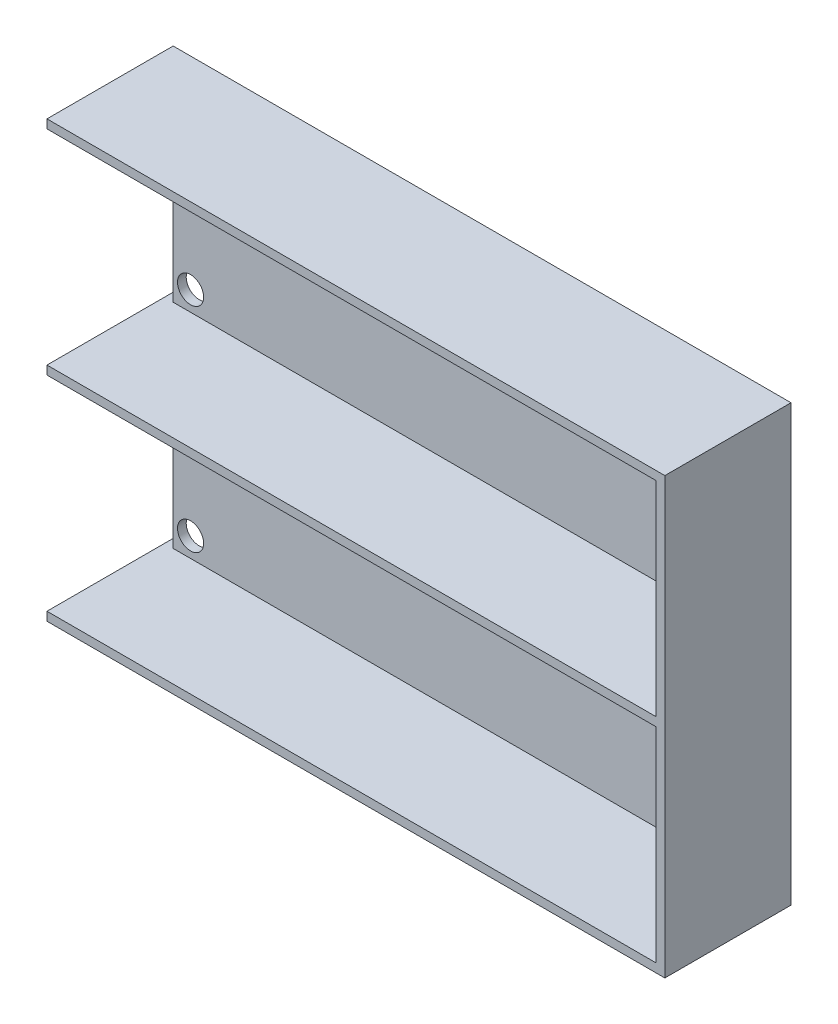
ISO-10303-21;
HEADER;
FILE_DESCRIPTION(('STEP AP214'),'2;1');
FILE_NAME('part.step','',(''),(''),'','','');
FILE_SCHEMA(('AUTOMOTIVE_DESIGN { 1 0 10303 214 1 1 1 1 }'));
ENDSEC;
DATA;
#1=APPLICATION_CONTEXT('core data for automotive mechanical design processes');
#2=APPLICATION_PROTOCOL_DEFINITION('international standard','automotive_design',2000,#1);
#3=PRODUCT_CONTEXT('',#1,'mechanical');
#4=PRODUCT('Part','Part','',(#3));
#5=PRODUCT_RELATED_PRODUCT_CATEGORY('part','',(#4));
#6=PRODUCT_DEFINITION_FORMATION('','',#4);
#7=PRODUCT_DEFINITION_CONTEXT('part definition',#1,'design');
#8=PRODUCT_DEFINITION('design','',#6,#7);
#9=PRODUCT_DEFINITION_SHAPE('','',#8);
#10=(LENGTH_UNIT() NAMED_UNIT(*) SI_UNIT(.MILLI.,.METRE.));
#11=(NAMED_UNIT(*) PLANE_ANGLE_UNIT() SI_UNIT($,.RADIAN.));
#12=(NAMED_UNIT(*) SI_UNIT($,.STERADIAN.) SOLID_ANGLE_UNIT());
#13=UNCERTAINTY_MEASURE_WITH_UNIT(LENGTH_MEASURE(1.E-05),#10,'distance_accuracy_value','');
#14=(GEOMETRIC_REPRESENTATION_CONTEXT(3) GLOBAL_UNCERTAINTY_ASSIGNED_CONTEXT((#13)) GLOBAL_UNIT_ASSIGNED_CONTEXT((#10,
#11,#12)) REPRESENTATION_CONTEXT('',''));
#15=CARTESIAN_POINT('',(0.,0.,0.));
#16=DIRECTION('',(0.,0.,1.));
#17=DIRECTION('',(1.,0.,0.));
#18=AXIS2_PLACEMENT_3D('',#15,#16,#17);
#19=CARTESIAN_POINT('',(-62.5513317977968,46.7896654801157,2.));
#20=DIRECTION('',(1.,0.,0.));
#21=DIRECTION('',(0.,1.,0.));
#22=AXIS2_PLACEMENT_3D('',#19,#20,#21);
#23=PLANE('',#22);
#24=DIRECTION('',(0.,0.,-1.));
#25=VECTOR('',#24,1.);
#26=CARTESIAN_POINT('',(-62.5513317977967,-51.2103345198843,29.));
#27=LINE('',#26,#25);
#28=CARTESIAN_POINT('',(-62.5513317977967,-51.2103345198843,29.));
#29=VERTEX_POINT('',#28);
#30=CARTESIAN_POINT('',(-62.5513317977967,-51.2103345198843,0.));
#31=VERTEX_POINT('',#30);
#32=EDGE_CURVE('E227',#29,#31,#27,.T.);
#33=ORIENTED_EDGE('',*,*,#32,.T.);
#34=DIRECTION('',(0.,-1.,0.));
#35=VECTOR('',#34,1.);
#36=CARTESIAN_POINT('',(-62.5513317977968,46.7896654801157,0.));
#37=LINE('',#36,#35);
#38=CARTESIAN_POINT('',(-62.5513317977967,-53.2103345198843,0.));
#39=VERTEX_POINT('',#38);
#40=EDGE_CURVE('E252',#31,#39,#37,.T.);
#41=ORIENTED_EDGE('',*,*,#40,.T.);
#42=DIRECTION('',(0.,0.,-1.));
#43=VECTOR('',#42,1.);
#44=CARTESIAN_POINT('',(-62.5513317977967,-53.2103345198843,2.));
#45=LINE('',#44,#43);
#46=CARTESIAN_POINT('',(-62.5513317977967,-53.2103345198843,29.));
#47=VERTEX_POINT('',#46);
#48=EDGE_CURVE('E11',#47,#39,#45,.T.);
#49=ORIENTED_EDGE('',*,*,#48,.F.);
#50=DIRECTION('',(0.,-1.,0.));
#51=VECTOR('',#50,1.);
#52=CARTESIAN_POINT('',(-62.5513317977967,-53.2103345198843,29.));
#53=LINE('',#52,#51);
#54=EDGE_CURVE('E199',#29,#47,#53,.T.);
#55=ORIENTED_EDGE('',*,*,#54,.F.);
#56=EDGE_LOOP('',(#33,#41,#49,#55));
#57=FACE_BOUND('',#56,.T.);
#58=ADVANCED_FACE('F34',(#57),#23,.F.);
#59=CARTESIAN_POINT('',(-62.5513317977968,46.7896654801157,0.));
#60=VERTEX_POINT('',#59);
#61=CARTESIAN_POINT('',(-62.5513317977968,44.7896654801157,0.));
#62=VERTEX_POINT('',#61);
#63=EDGE_CURVE('E270',#60,#62,#37,.T.);
#64=ORIENTED_EDGE('',*,*,#63,.T.);
#65=DIRECTION('',(0.,0.,-1.));
#66=VECTOR('',#65,1.);
#67=CARTESIAN_POINT('',(-62.5513317977968,44.7896654801157,29.));
#68=LINE('',#67,#66);
#69=CARTESIAN_POINT('',(-62.5513317977968,44.7896654801157,29.));
#70=VERTEX_POINT('',#69);
#71=EDGE_CURVE('E250',#70,#62,#68,.T.);
#72=ORIENTED_EDGE('',*,*,#71,.F.);
#73=DIRECTION('',(0.,-1.,0.));
#74=VECTOR('',#73,1.);
#75=CARTESIAN_POINT('',(-62.5513317977968,46.7896654801157,29.));
#76=LINE('',#75,#74);
#77=CARTESIAN_POINT('',(-62.5513317977968,46.7896654801157,29.));
#78=VERTEX_POINT('',#77);
#79=EDGE_CURVE('E211',#78,#70,#76,.T.);
#80=ORIENTED_EDGE('',*,*,#79,.F.);
#81=DIRECTION('',(0.,0.,-1.));
#82=VECTOR('',#81,1.);
#83=CARTESIAN_POINT('',(-62.5513317977968,46.7896654801157,2.));
#84=LINE('',#83,#82);
#85=EDGE_CURVE('E280',#78,#60,#84,.T.);
#86=ORIENTED_EDGE('',*,*,#85,.T.);
#87=EDGE_LOOP('',(#64,#72,#80,#86));
#88=FACE_BOUND('',#87,.T.);
#89=ADVANCED_FACE('F300',(#88),#23,.F.);
#90=CARTESIAN_POINT('',(0.,0.,2.));
#91=DIRECTION('',(0.,0.,1.));
#92=DIRECTION('',(1.,0.,0.));
#93=AXIS2_PLACEMENT_3D('',#90,#91,#92);
#94=PLANE('',#93);
#95=CARTESIAN_POINT('',(-56.5513317977968,-46.7103345198843,2.));
#96=DIRECTION('',(0.,0.,1.));
#97=DIRECTION('',(1.,0.,0.));
#98=AXIS2_PLACEMENT_3D('',#95,#96,#97);
#99=CIRCLE('',#98,3.);
#100=CARTESIAN_POINT('',(-53.5513317977968,-46.7103345198843,2.));
#101=VERTEX_POINT('',#100);
#102=EDGE_CURVE('E579',#101,#101,#99,.T.);
#103=ORIENTED_EDGE('',*,*,#102,.F.);
#104=EDGE_LOOP('',(#103));
#105=FACE_BOUND('',#104,.T.);
#106=CARTESIAN_POINT('',(-56.5513317977968,-8.71033451988431,2.));
#107=DIRECTION('',(0.,0.,1.));
#108=DIRECTION('',(1.,0.,0.));
#109=AXIS2_PLACEMENT_3D('',#106,#107,#108);
#110=CIRCLE('',#109,3.);
#111=CARTESIAN_POINT('',(-53.5513317977968,-8.71033451988431,2.));
#112=VERTEX_POINT('',#111);
#113=EDGE_CURVE('E589',#112,#112,#110,.T.);
#114=ORIENTED_EDGE('',*,*,#113,.F.);
#115=EDGE_LOOP('',(#114));
#116=FACE_BOUND('',#115,.T.);
#117=DIRECTION('',(0.,1.,0.));
#118=VECTOR('',#117,1.);
#119=CARTESIAN_POINT('',(-60.5513317977967,-4.21033451988427,2.));
#120=LINE('',#119,#118);
#121=CARTESIAN_POINT('',(-60.5513317977967,-51.2103345198843,2.));
#122=VERTEX_POINT('',#121);
#123=CARTESIAN_POINT('',(-60.5513317977967,-4.21033451988427,2.));
#124=VERTEX_POINT('',#123);
#125=EDGE_CURVE('E157',#122,#124,#120,.T.);
#126=ORIENTED_EDGE('',*,*,#125,.F.);
#127=DIRECTION('',(-1.,0.,0.));
#128=VECTOR('',#127,1.);
#129=CARTESIAN_POINT('',(-62.5513317977967,-51.2103345198843,2.));
#130=LINE('',#129,#128);
#131=CARTESIAN_POINT('',(77.4486682022033,-51.2103345198843,2.));
#132=VERTEX_POINT('',#131);
#133=EDGE_CURVE('E52',#132,#122,#130,.T.);
#134=ORIENTED_EDGE('',*,*,#133,.F.);
#135=DIRECTION('',(0.,-1.,0.));
#136=VECTOR('',#135,1.);
#137=CARTESIAN_POINT('',(77.4486682022033,-51.2103345198843,2.));
#138=LINE('',#137,#136);
#139=CARTESIAN_POINT('',(77.4486682022033,-4.21033451988427,2.));
#140=VERTEX_POINT('',#139);
#141=EDGE_CURVE('E234',#140,#132,#138,.T.);
#142=ORIENTED_EDGE('',*,*,#141,.F.);
#143=DIRECTION('',(1.,0.,0.));
#144=VECTOR('',#143,1.);
#145=CARTESIAN_POINT('',(-62.5513317977968,-4.21033451988427,2.));
#146=LINE('',#145,#144);
#147=EDGE_CURVE('E38',#124,#140,#146,.T.);
#148=ORIENTED_EDGE('',*,*,#147,.F.);
#149=EDGE_LOOP('',(#126,#134,#142,#148));
#150=FACE_BOUND('',#149,.T.);
#151=ADVANCED_FACE('F337',(#105,#116,#150),#94,.T.);
#152=CARTESIAN_POINT('',(-62.5513317977968,-2.21033451988435,0.));
#153=VERTEX_POINT('',#152);
#154=CARTESIAN_POINT('',(-62.5513317977968,-4.21033451988427,0.));
#155=VERTEX_POINT('',#154);
#156=EDGE_CURVE('E274',#153,#155,#37,.T.);
#157=ORIENTED_EDGE('',*,*,#156,.T.);
#158=DIRECTION('',(0.,0.,-1.));
#159=VECTOR('',#158,1.);
#160=CARTESIAN_POINT('',(-62.5513317977968,-4.21033451988427,29.));
#161=LINE('',#160,#159);
#162=CARTESIAN_POINT('',(-62.5513317977968,-4.21033451988427,29.));
#163=VERTEX_POINT('',#162);
#164=EDGE_CURVE('E166',#163,#155,#161,.T.);
#165=ORIENTED_EDGE('',*,*,#164,.F.);
#166=DIRECTION('',(0.,-1.,0.));
#167=VECTOR('',#166,1.);
#168=CARTESIAN_POINT('',(-62.5513317977968,-2.21033451988436,29.));
#169=LINE('',#168,#167);
#170=CARTESIAN_POINT('',(-62.5513317977968,-2.21033451988436,29.));
#171=VERTEX_POINT('',#170);
#172=EDGE_CURVE('E219',#171,#163,#169,.T.);
#173=ORIENTED_EDGE('',*,*,#172,.F.);
#174=DIRECTION('',(0.,0.,-1.));
#175=VECTOR('',#174,1.);
#176=CARTESIAN_POINT('',(-62.5513317977968,-2.21033451988436,29.));
#177=LINE('',#176,#175);
#178=EDGE_CURVE('E242',#171,#153,#177,.T.);
#179=ORIENTED_EDGE('',*,*,#178,.T.);
#180=EDGE_LOOP('',(#157,#165,#173,#179));
#181=FACE_BOUND('',#180,.T.);
#182=ADVANCED_FACE('F36',(#181),#23,.F.);
#183=CARTESIAN_POINT('',(-62.5513317977967,-53.2103345198843,2.));
#184=DIRECTION('',(0.,1.,0.));
#185=DIRECTION('',(0.,0.,1.));
#186=AXIS2_PLACEMENT_3D('',#183,#184,#185);
#187=PLANE('',#186);
#188=DIRECTION('',(1.,0.,0.));
#189=VECTOR('',#188,1.);
#190=CARTESIAN_POINT('',(-62.5513317977967,-53.2103345198843,0.));
#191=LINE('',#190,#189);
#192=CARTESIAN_POINT('',(79.4486682022032,-53.2103345198843,0.));
#193=VERTEX_POINT('',#192);
#194=EDGE_CURVE('E273',#39,#193,#191,.T.);
#195=ORIENTED_EDGE('',*,*,#194,.T.);
#196=DIRECTION('',(0.,0.,-1.));
#197=VECTOR('',#196,1.);
#198=CARTESIAN_POINT('',(79.4486682022032,-53.2103345198843,2.));
#199=LINE('',#198,#197);
#200=CARTESIAN_POINT('',(79.4486682022032,-53.2103345198843,29.));
#201=VERTEX_POINT('',#200);
#202=EDGE_CURVE('E44',#201,#193,#199,.T.);
#203=ORIENTED_EDGE('',*,*,#202,.F.);
#204=DIRECTION('',(1.,0.,0.));
#205=VECTOR('',#204,1.);
#206=CARTESIAN_POINT('',(-62.5513317977967,-53.2103345198843,29.));
#207=LINE('',#206,#205);
#208=EDGE_CURVE('E202',#47,#201,#207,.T.);
#209=ORIENTED_EDGE('',*,*,#208,.F.);
#210=ORIENTED_EDGE('',*,*,#48,.T.);
#211=EDGE_LOOP('',(#195,#203,#209,#210));
#212=FACE_BOUND('',#211,.T.);
#213=ADVANCED_FACE('F307',(#212),#187,.F.);
#214=CARTESIAN_POINT('',(79.4486682022032,46.7896654801157,2.));
#215=DIRECTION('',(-1.,0.,0.));
#216=DIRECTION('',(0.,-1.,0.));
#217=AXIS2_PLACEMENT_3D('',#214,#215,#216);
#218=PLANE('',#217);
#219=DIRECTION('',(0.,1.,0.));
#220=VECTOR('',#219,1.);
#221=CARTESIAN_POINT('',(79.4486682022032,46.7896654801157,0.));
#222=LINE('',#221,#220);
#223=CARTESIAN_POINT('',(79.4486682022032,46.7896654801157,0.));
#224=VERTEX_POINT('',#223);
#225=EDGE_CURVE('E276',#193,#224,#222,.T.);
#226=ORIENTED_EDGE('',*,*,#225,.T.);
#227=DIRECTION('',(0.,0.,-1.));
#228=VECTOR('',#227,1.);
#229=CARTESIAN_POINT('',(79.4486682022032,46.7896654801157,2.));
#230=LINE('',#229,#228);
#231=CARTESIAN_POINT('',(79.4486682022032,46.7896654801157,29.));
#232=VERTEX_POINT('',#231);
#233=EDGE_CURVE('E283',#232,#224,#230,.T.);
#234=ORIENTED_EDGE('',*,*,#233,.F.);
#235=DIRECTION('',(0.,1.,0.));
#236=VECTOR('',#235,1.);
#237=CARTESIAN_POINT('',(79.4486682022032,-53.2103345198843,29.));
#238=LINE('',#237,#236);
#239=EDGE_CURVE('E205',#201,#232,#238,.T.);
#240=ORIENTED_EDGE('',*,*,#239,.F.);
#241=ORIENTED_EDGE('',*,*,#202,.T.);
#242=EDGE_LOOP('',(#226,#234,#240,#241));
#243=FACE_BOUND('',#242,.T.);
#244=ADVANCED_FACE('F289',(#243),#218,.F.);
#245=CARTESIAN_POINT('',(-62.5513317977968,46.7896654801157,2.));
#246=DIRECTION('',(0.,-1.,0.));
#247=DIRECTION('',(0.,0.,-1.));
#248=AXIS2_PLACEMENT_3D('',#245,#246,#247);
#249=PLANE('',#248);
#250=DIRECTION('',(-1.,0.,0.));
#251=VECTOR('',#250,1.);
#252=CARTESIAN_POINT('',(-62.5513317977968,46.7896654801157,0.));
#253=LINE('',#252,#251);
#254=EDGE_CURVE('E278',#224,#60,#253,.T.);
#255=ORIENTED_EDGE('',*,*,#254,.T.);
#256=ORIENTED_EDGE('',*,*,#85,.F.);
#257=DIRECTION('',(-1.,0.,0.));
#258=VECTOR('',#257,1.);
#259=CARTESIAN_POINT('',(79.4486682022032,46.7896654801157,29.));
#260=LINE('',#259,#258);
#261=EDGE_CURVE('E208',#232,#78,#260,.T.);
#262=ORIENTED_EDGE('',*,*,#261,.F.);
#263=ORIENTED_EDGE('',*,*,#233,.T.);
#264=EDGE_LOOP('',(#255,#256,#262,#263));
#265=FACE_BOUND('',#264,.T.);
#266=ADVANCED_FACE('F296',(#265),#249,.F.);
#267=CARTESIAN_POINT('',(-56.5513317977968,2.28966548011569,2.));
#268=DIRECTION('',(0.,0.,1.));
#269=DIRECTION('',(1.,0.,0.));
#270=AXIS2_PLACEMENT_3D('',#267,#268,#269);
#271=CIRCLE('',#270,3.);
#272=CARTESIAN_POINT('',(-53.5513317977968,2.28966548011569,2.));
#273=VERTEX_POINT('',#272);
#274=EDGE_CURVE('E595',#273,#273,#271,.T.);
#275=ORIENTED_EDGE('',*,*,#274,.F.);
#276=EDGE_LOOP('',(#275));
#277=FACE_BOUND('',#276,.T.);
#278=CARTESIAN_POINT('',(-56.5513317977968,40.2896654801157,2.));
#279=DIRECTION('',(0.,0.,1.));
#280=DIRECTION('',(1.,0.,0.));
#281=AXIS2_PLACEMENT_3D('',#278,#279,#280);
#282=CIRCLE('',#281,3.);
#283=CARTESIAN_POINT('',(-53.5513317977968,40.2896654801157,2.));
#284=VERTEX_POINT('',#283);
#285=EDGE_CURVE('E175',#284,#284,#282,.T.);
#286=ORIENTED_EDGE('',*,*,#285,.F.);
#287=EDGE_LOOP('',(#286));
#288=FACE_BOUND('',#287,.T.);
#289=DIRECTION('',(0.,1.,0.));
#290=VECTOR('',#289,1.);
#291=CARTESIAN_POINT('',(-60.5513317977967,-2.21033451988435,2.));
#292=LINE('',#291,#290);
#293=CARTESIAN_POINT('',(-60.5513317977967,-2.21033451988435,2.));
#294=VERTEX_POINT('',#293);
#295=CARTESIAN_POINT('',(-60.5513317977967,44.7896654801157,2.));
#296=VERTEX_POINT('',#295);
#297=EDGE_CURVE('E181',#294,#296,#292,.T.);
#298=ORIENTED_EDGE('',*,*,#297,.F.);
#299=DIRECTION('',(-1.,0.,0.));
#300=VECTOR('',#299,1.);
#301=CARTESIAN_POINT('',(-62.5513317977968,-2.21033451988436,2.));
#302=LINE('',#301,#300);
#303=CARTESIAN_POINT('',(77.4486682022033,-2.21033451988436,2.));
#304=VERTEX_POINT('',#303);
#305=EDGE_CURVE('E231',#304,#294,#302,.T.);
#306=ORIENTED_EDGE('',*,*,#305,.F.);
#307=DIRECTION('',(0.,-1.,0.));
#308=VECTOR('',#307,1.);
#309=CARTESIAN_POINT('',(77.4486682022033,-2.21033451988436,2.));
#310=LINE('',#309,#308);
#311=CARTESIAN_POINT('',(77.4486682022032,44.7896654801157,2.));
#312=VERTEX_POINT('',#311);
#313=EDGE_CURVE('E228',#312,#304,#310,.T.);
#314=ORIENTED_EDGE('',*,*,#313,.F.);
#315=DIRECTION('',(1.,0.,0.));
#316=VECTOR('',#315,1.);
#317=CARTESIAN_POINT('',(77.4486682022032,44.7896654801157,2.));
#318=LINE('',#317,#316);
#319=EDGE_CURVE('E197',#296,#312,#318,.T.);
#320=ORIENTED_EDGE('',*,*,#319,.F.);
#321=EDGE_LOOP('',(#298,#306,#314,#320));
#322=FACE_BOUND('',#321,.T.);
#323=ADVANCED_FACE('F341',(#277,#288,#322),#94,.T.);
#324=CARTESIAN_POINT('',(0.,0.,0.));
#325=DIRECTION('',(0.,0.,1.));
#326=DIRECTION('',(1.,0.,0.));
#327=AXIS2_PLACEMENT_3D('',#324,#325,#326);
#328=PLANE('',#327);
#329=CARTESIAN_POINT('',(-56.5513317977968,-46.7103345198843,0.));
#330=DIRECTION('',(0.,0.,-1.));
#331=DIRECTION('',(-1.,0.,0.));
#332=AXIS2_PLACEMENT_3D('',#329,#330,#331);
#333=CIRCLE('',#332,3.);
#334=CARTESIAN_POINT('',(-59.5513317977968,-46.7103345198843,0.));
#335=VERTEX_POINT('',#334);
#336=EDGE_CURVE('E582',#335,#335,#333,.T.);
#337=ORIENTED_EDGE('',*,*,#336,.F.);
#338=EDGE_LOOP('',(#337));
#339=FACE_BOUND('',#338,.T.);
#340=CARTESIAN_POINT('',(-56.5513317977968,-8.71033451988431,0.));
#341=DIRECTION('',(0.,0.,-1.));
#342=DIRECTION('',(-1.,0.,0.));
#343=AXIS2_PLACEMENT_3D('',#340,#341,#342);
#344=CIRCLE('',#343,3.);
#345=CARTESIAN_POINT('',(-59.5513317977968,-8.71033451988431,0.));
#346=VERTEX_POINT('',#345);
#347=EDGE_CURVE('E584',#346,#346,#344,.T.);
#348=ORIENTED_EDGE('',*,*,#347,.F.);
#349=EDGE_LOOP('',(#348));
#350=FACE_BOUND('',#349,.T.);
#351=CARTESIAN_POINT('',(-56.5513317977968,2.28966548011569,0.));
#352=DIRECTION('',(0.,0.,-1.));
#353=DIRECTION('',(-1.,0.,0.));
#354=AXIS2_PLACEMENT_3D('',#351,#352,#353);
#355=CIRCLE('',#354,3.);
#356=CARTESIAN_POINT('',(-59.5513317977968,2.28966548011569,0.));
#357=VERTEX_POINT('',#356);
#358=EDGE_CURVE('E592',#357,#357,#355,.T.);
#359=ORIENTED_EDGE('',*,*,#358,.F.);
#360=EDGE_LOOP('',(#359));
#361=FACE_BOUND('',#360,.T.);
#362=CARTESIAN_POINT('',(-56.5513317977968,40.2896654801157,0.));
#363=DIRECTION('',(0.,0.,-1.));
#364=DIRECTION('',(-1.,0.,0.));
#365=AXIS2_PLACEMENT_3D('',#362,#363,#364);
#366=CIRCLE('',#365,3.);
#367=CARTESIAN_POINT('',(-59.5513317977968,40.2896654801157,0.));
#368=VERTEX_POINT('',#367);
#369=EDGE_CURVE('E597',#368,#368,#366,.T.);
#370=ORIENTED_EDGE('',*,*,#369,.F.);
#371=EDGE_LOOP('',(#370));
#372=FACE_BOUND('',#371,.T.);
#373=ORIENTED_EDGE('',*,*,#40,.F.);
#374=DIRECTION('',(1.,0.,0.));
#375=VECTOR('',#374,1.);
#376=CARTESIAN_POINT('',(-60.5513317977967,-51.2103345198843,0.));
#377=LINE('',#376,#375);
#378=CARTESIAN_POINT('',(-60.5513317977967,-51.2103345198843,0.));
#379=VERTEX_POINT('',#378);
#380=EDGE_CURVE('E159',#31,#379,#377,.T.);
#381=ORIENTED_EDGE('',*,*,#380,.T.);
#382=DIRECTION('',(0.,1.,0.));
#383=VECTOR('',#382,1.);
#384=CARTESIAN_POINT('',(-60.5513317977967,-4.21033451988427,0.));
#385=LINE('',#384,#383);
#386=CARTESIAN_POINT('',(-60.5513317977967,-4.21033451988427,0.));
#387=VERTEX_POINT('',#386);
#388=EDGE_CURVE('E155',#379,#387,#385,.T.);
#389=ORIENTED_EDGE('',*,*,#388,.T.);
#390=DIRECTION('',(-1.,0.,0.));
#391=VECTOR('',#390,1.);
#392=CARTESIAN_POINT('',(-60.5513317977967,-4.21033451988427,0.));
#393=LINE('',#392,#391);
#394=EDGE_CURVE('E162',#387,#155,#393,.T.);
#395=ORIENTED_EDGE('',*,*,#394,.T.);
#396=ORIENTED_EDGE('',*,*,#156,.F.);
#397=DIRECTION('',(1.,0.,0.));
#398=VECTOR('',#397,1.);
#399=CARTESIAN_POINT('',(-62.5513317977968,-2.21033451988435,0.));
#400=LINE('',#399,#398);
#401=CARTESIAN_POINT('',(-60.5513317977967,-2.21033451988435,0.));
#402=VERTEX_POINT('',#401);
#403=EDGE_CURVE('E183',#153,#402,#400,.T.);
#404=ORIENTED_EDGE('',*,*,#403,.T.);
#405=DIRECTION('',(0.,1.,0.));
#406=VECTOR('',#405,1.);
#407=CARTESIAN_POINT('',(-60.5513317977967,-2.21033451988435,0.));
#408=LINE('',#407,#406);
#409=CARTESIAN_POINT('',(-60.5513317977967,44.7896654801157,0.));
#410=VERTEX_POINT('',#409);
#411=EDGE_CURVE('E186',#402,#410,#408,.T.);
#412=ORIENTED_EDGE('',*,*,#411,.T.);
#413=DIRECTION('',(-1.,0.,0.));
#414=VECTOR('',#413,1.);
#415=CARTESIAN_POINT('',(-62.5513317977968,44.7896654801157,0.));
#416=LINE('',#415,#414);
#417=EDGE_CURVE('E189',#410,#62,#416,.T.);
#418=ORIENTED_EDGE('',*,*,#417,.T.);
#419=ORIENTED_EDGE('',*,*,#63,.F.);
#420=ORIENTED_EDGE('',*,*,#254,.F.);
#421=ORIENTED_EDGE('',*,*,#225,.F.);
#422=ORIENTED_EDGE('',*,*,#194,.F.);
#423=EDGE_LOOP('',(#373,#381,#389,#395,#396,#404,#412,#418,#419,#420,#421,#422));
#424=FACE_BOUND('',#423,.T.);
#425=ADVANCED_FACE('F172',(#339,#350,#361,#372,#424),#328,.F.);
#426=CARTESIAN_POINT('',(77.4486682022032,44.7896654801157,29.));
#427=DIRECTION('',(0.,1.,0.));
#428=DIRECTION('',(-1.,0.,0.));
#429=AXIS2_PLACEMENT_3D('',#426,#427,#428);
#430=PLANE('',#429);
#431=ORIENTED_EDGE('',*,*,#71,.T.);
#432=ORIENTED_EDGE('',*,*,#417,.F.);
#433=DIRECTION('',(0.,0.,1.));
#434=VECTOR('',#433,1.);
#435=CARTESIAN_POINT('',(-60.5513317977967,44.7896654801157,0.));
#436=LINE('',#435,#434);
#437=EDGE_CURVE('E195',#410,#296,#436,.T.);
#438=ORIENTED_EDGE('',*,*,#437,.T.);
#439=ORIENTED_EDGE('',*,*,#319,.T.);
#440=DIRECTION('',(0.,0.,-1.));
#441=VECTOR('',#440,1.);
#442=CARTESIAN_POINT('',(77.4486682022032,44.7896654801157,29.));
#443=LINE('',#442,#441);
#444=CARTESIAN_POINT('',(77.4486682022032,44.7896654801157,29.));
#445=VERTEX_POINT('',#444);
#446=EDGE_CURVE('E253',#445,#312,#443,.T.);
#447=ORIENTED_EDGE('',*,*,#446,.F.);
#448=DIRECTION('',(1.,0.,0.));
#449=VECTOR('',#448,1.);
#450=CARTESIAN_POINT('',(77.4486682022032,44.7896654801157,29.));
#451=LINE('',#450,#449);
#452=EDGE_CURVE('E213',#70,#445,#451,.T.);
#453=ORIENTED_EDGE('',*,*,#452,.F.);
#454=EDGE_LOOP('',(#431,#432,#438,#439,#447,#453));
#455=FACE_BOUND('',#454,.T.);
#456=ADVANCED_FACE('F324',(#455),#430,.F.);
#457=CARTESIAN_POINT('',(77.4486682022033,-2.21033451988436,29.));
#458=DIRECTION('',(1.,0.,0.));
#459=DIRECTION('',(0.,1.,0.));
#460=AXIS2_PLACEMENT_3D('',#457,#458,#459);
#461=PLANE('',#460);
#462=ORIENTED_EDGE('',*,*,#313,.T.);
#463=DIRECTION('',(0.,0.,-1.));
#464=VECTOR('',#463,1.);
#465=CARTESIAN_POINT('',(77.4486682022033,-2.21033451988436,29.));
#466=LINE('',#465,#464);
#467=CARTESIAN_POINT('',(77.4486682022033,-2.21033451988436,29.));
#468=VERTEX_POINT('',#467);
#469=EDGE_CURVE('E244',#468,#304,#466,.T.);
#470=ORIENTED_EDGE('',*,*,#469,.F.);
#471=DIRECTION('',(0.,-1.,0.));
#472=VECTOR('',#471,1.);
#473=CARTESIAN_POINT('',(77.4486682022033,-2.21033451988436,29.));
#474=LINE('',#473,#472);
#475=EDGE_CURVE('E215',#445,#468,#474,.T.);
#476=ORIENTED_EDGE('',*,*,#475,.F.);
#477=ORIENTED_EDGE('',*,*,#446,.T.);
#478=EDGE_LOOP('',(#462,#470,#476,#477));
#479=FACE_BOUND('',#478,.T.);
#480=ADVANCED_FACE('F329',(#479),#461,.F.);
#481=CARTESIAN_POINT('',(-62.5513317977968,-2.21033451988436,29.));
#482=DIRECTION('',(0.,-1.,0.));
#483=DIRECTION('',(0.,0.,-1.));
#484=AXIS2_PLACEMENT_3D('',#481,#482,#483);
#485=PLANE('',#484);
#486=ORIENTED_EDGE('',*,*,#305,.T.);
#487=DIRECTION('',(0.,0.,1.));
#488=VECTOR('',#487,1.);
#489=CARTESIAN_POINT('',(-60.5513317977967,-2.21033451988435,0.));
#490=LINE('',#489,#488);
#491=EDGE_CURVE('E192',#402,#294,#490,.T.);
#492=ORIENTED_EDGE('',*,*,#491,.F.);
#493=ORIENTED_EDGE('',*,*,#403,.F.);
#494=ORIENTED_EDGE('',*,*,#178,.F.);
#495=DIRECTION('',(-1.,0.,0.));
#496=VECTOR('',#495,1.);
#497=CARTESIAN_POINT('',(-62.5513317977968,-2.21033451988436,29.));
#498=LINE('',#497,#496);
#499=EDGE_CURVE('E217',#468,#171,#498,.T.);
#500=ORIENTED_EDGE('',*,*,#499,.F.);
#501=ORIENTED_EDGE('',*,*,#469,.T.);
#502=EDGE_LOOP('',(#486,#492,#493,#494,#500,#501));
#503=FACE_BOUND('',#502,.T.);
#504=ADVANCED_FACE('F316',(#503),#485,.F.);
#505=CARTESIAN_POINT('',(-62.5513317977968,-4.21033451988427,29.));
#506=DIRECTION('',(0.,1.,0.));
#507=DIRECTION('',(0.,0.,1.));
#508=AXIS2_PLACEMENT_3D('',#505,#506,#507);
#509=PLANE('',#508);
#510=ORIENTED_EDGE('',*,*,#164,.T.);
#511=ORIENTED_EDGE('',*,*,#394,.F.);
#512=DIRECTION('',(0.,0.,1.));
#513=VECTOR('',#512,1.);
#514=CARTESIAN_POINT('',(-60.5513317977967,-4.21033451988427,0.));
#515=LINE('',#514,#513);
#516=EDGE_CURVE('E151',#387,#124,#515,.T.);
#517=ORIENTED_EDGE('',*,*,#516,.T.);
#518=ORIENTED_EDGE('',*,*,#147,.T.);
#519=DIRECTION('',(0.,0.,-1.));
#520=VECTOR('',#519,1.);
#521=CARTESIAN_POINT('',(77.4486682022033,-4.21033451988427,29.));
#522=LINE('',#521,#520);
#523=CARTESIAN_POINT('',(77.4486682022033,-4.21033451988427,29.));
#524=VERTEX_POINT('',#523);
#525=EDGE_CURVE('E263',#524,#140,#522,.T.);
#526=ORIENTED_EDGE('',*,*,#525,.F.);
#527=DIRECTION('',(1.,0.,0.));
#528=VECTOR('',#527,1.);
#529=CARTESIAN_POINT('',(-62.5513317977968,-4.21033451988427,29.));
#530=LINE('',#529,#528);
#531=EDGE_CURVE('E221',#163,#524,#530,.T.);
#532=ORIENTED_EDGE('',*,*,#531,.F.);
#533=EDGE_LOOP('',(#510,#511,#517,#518,#526,#532));
#534=FACE_BOUND('',#533,.T.);
#535=ADVANCED_FACE('F163',(#534),#509,.F.);
#536=CARTESIAN_POINT('',(77.4486682022033,-51.2103345198843,29.));
#537=DIRECTION('',(1.,0.,0.));
#538=DIRECTION('',(0.,0.,-1.));
#539=AXIS2_PLACEMENT_3D('',#536,#537,#538);
#540=PLANE('',#539);
#541=ORIENTED_EDGE('',*,*,#141,.T.);
#542=DIRECTION('',(0.,0.,-1.));
#543=VECTOR('',#542,1.);
#544=CARTESIAN_POINT('',(77.4486682022033,-51.2103345198843,29.));
#545=LINE('',#544,#543);
#546=CARTESIAN_POINT('',(77.4486682022033,-51.2103345198843,29.));
#547=VERTEX_POINT('',#546);
#548=EDGE_CURVE('E260',#547,#132,#545,.T.);
#549=ORIENTED_EDGE('',*,*,#548,.F.);
#550=DIRECTION('',(0.,-1.,0.));
#551=VECTOR('',#550,1.);
#552=CARTESIAN_POINT('',(77.4486682022033,-51.2103345198843,29.));
#553=LINE('',#552,#551);
#554=EDGE_CURVE('E223',#524,#547,#553,.T.);
#555=ORIENTED_EDGE('',*,*,#554,.F.);
#556=ORIENTED_EDGE('',*,*,#525,.T.);
#557=EDGE_LOOP('',(#541,#549,#555,#556));
#558=FACE_BOUND('',#557,.T.);
#559=ADVANCED_FACE('F333',(#558),#540,.F.);
#560=CARTESIAN_POINT('',(-62.5513317977967,-51.2103345198843,29.));
#561=DIRECTION('',(0.,-1.,0.));
#562=DIRECTION('',(0.,0.,-1.));
#563=AXIS2_PLACEMENT_3D('',#560,#561,#562);
#564=PLANE('',#563);
#565=ORIENTED_EDGE('',*,*,#133,.T.);
#566=DIRECTION('',(0.,0.,1.));
#567=VECTOR('',#566,1.);
#568=CARTESIAN_POINT('',(-60.5513317977967,-51.2103345198843,0.));
#569=LINE('',#568,#567);
#570=EDGE_CURVE('E158',#379,#122,#569,.T.);
#571=ORIENTED_EDGE('',*,*,#570,.F.);
#572=ORIENTED_EDGE('',*,*,#380,.F.);
#573=ORIENTED_EDGE('',*,*,#32,.F.);
#574=DIRECTION('',(-1.,0.,0.));
#575=VECTOR('',#574,1.);
#576=CARTESIAN_POINT('',(-62.5513317977967,-51.2103345198843,29.));
#577=LINE('',#576,#575);
#578=EDGE_CURVE('E225',#547,#29,#577,.T.);
#579=ORIENTED_EDGE('',*,*,#578,.F.);
#580=ORIENTED_EDGE('',*,*,#548,.T.);
#581=EDGE_LOOP('',(#565,#571,#572,#573,#579,#580));
#582=FACE_BOUND('',#581,.T.);
#583=ADVANCED_FACE('F336',(#582),#564,.F.);
#584=CARTESIAN_POINT('',(0.,0.,29.));
#585=DIRECTION('',(0.,0.,-1.));
#586=DIRECTION('',(-1.,0.,0.));
#587=AXIS2_PLACEMENT_3D('',#584,#585,#586);
#588=PLANE('',#587);
#589=ORIENTED_EDGE('',*,*,#54,.T.);
#590=ORIENTED_EDGE('',*,*,#208,.T.);
#591=ORIENTED_EDGE('',*,*,#239,.T.);
#592=ORIENTED_EDGE('',*,*,#261,.T.);
#593=ORIENTED_EDGE('',*,*,#79,.T.);
#594=ORIENTED_EDGE('',*,*,#452,.T.);
#595=ORIENTED_EDGE('',*,*,#475,.T.);
#596=ORIENTED_EDGE('',*,*,#499,.T.);
#597=ORIENTED_EDGE('',*,*,#172,.T.);
#598=ORIENTED_EDGE('',*,*,#531,.T.);
#599=ORIENTED_EDGE('',*,*,#554,.T.);
#600=ORIENTED_EDGE('',*,*,#578,.T.);
#601=EDGE_LOOP('',(#589,#590,#591,#592,#593,#594,#595,#596,#597,#598,#599,#600));
#602=FACE_BOUND('',#601,.T.);
#603=ADVANCED_FACE('F304',(#602),#588,.F.);
#604=CARTESIAN_POINT('',(-60.5513317977967,-2.21033451988435,0.));
#605=DIRECTION('',(1.,0.,0.));
#606=DIRECTION('',(0.,0.,-1.));
#607=AXIS2_PLACEMENT_3D('',#604,#605,#606);
#608=PLANE('',#607);
#609=ORIENTED_EDGE('',*,*,#297,.T.);
#610=ORIENTED_EDGE('',*,*,#437,.F.);
#611=ORIENTED_EDGE('',*,*,#411,.F.);
#612=ORIENTED_EDGE('',*,*,#491,.T.);
#613=EDGE_LOOP('',(#609,#610,#611,#612));
#614=FACE_BOUND('',#613,.T.);
#615=ADVANCED_FACE('F320',(#614),#608,.F.);
#616=CARTESIAN_POINT('',(-60.5513317977967,-4.21033451988427,0.));
#617=DIRECTION('',(1.,0.,0.));
#618=DIRECTION('',(0.,1.,0.));
#619=AXIS2_PLACEMENT_3D('',#616,#617,#618);
#620=PLANE('',#619);
#621=ORIENTED_EDGE('',*,*,#125,.T.);
#622=ORIENTED_EDGE('',*,*,#516,.F.);
#623=ORIENTED_EDGE('',*,*,#388,.F.);
#624=ORIENTED_EDGE('',*,*,#570,.T.);
#625=EDGE_LOOP('',(#621,#622,#623,#624));
#626=FACE_BOUND('',#625,.T.);
#627=ADVANCED_FACE('F153',(#626),#620,.F.);
#628=CARTESIAN_POINT('',(-56.5513317977968,40.2896654801157,29.));
#629=DIRECTION('',(0.,0.,-1.));
#630=DIRECTION('',(-1.,0.,0.));
#631=AXIS2_PLACEMENT_3D('',#628,#629,#630);
#632=CYLINDRICAL_SURFACE('',#631,3.);
#633=ORIENTED_EDGE('',*,*,#285,.T.);
#634=EDGE_LOOP('',(#633));
#635=FACE_BOUND('',#634,.T.);
#636=ORIENTED_EDGE('',*,*,#369,.T.);
#637=EDGE_LOOP('',(#636));
#638=FACE_BOUND('',#637,.T.);
#639=ADVANCED_FACE('F454',(#635,#638),#632,.F.);
#640=CARTESIAN_POINT('',(-56.5513317977968,2.28966548011569,29.));
#641=DIRECTION('',(0.,0.,-1.));
#642=DIRECTION('',(-1.,0.,0.));
#643=AXIS2_PLACEMENT_3D('',#640,#641,#642);
#644=CYLINDRICAL_SURFACE('',#643,3.);
#645=ORIENTED_EDGE('',*,*,#274,.T.);
#646=EDGE_LOOP('',(#645));
#647=FACE_BOUND('',#646,.T.);
#648=ORIENTED_EDGE('',*,*,#358,.T.);
#649=EDGE_LOOP('',(#648));
#650=FACE_BOUND('',#649,.T.);
#651=ADVANCED_FACE('F460',(#647,#650),#644,.F.);
#652=CARTESIAN_POINT('',(-56.5513317977968,-8.71033451988431,29.));
#653=DIRECTION('',(0.,0.,-1.));
#654=DIRECTION('',(-1.,0.,0.));
#655=AXIS2_PLACEMENT_3D('',#652,#653,#654);
#656=CYLINDRICAL_SURFACE('',#655,3.);
#657=ORIENTED_EDGE('',*,*,#113,.T.);
#658=EDGE_LOOP('',(#657));
#659=FACE_BOUND('',#658,.T.);
#660=ORIENTED_EDGE('',*,*,#347,.T.);
#661=EDGE_LOOP('',(#660));
#662=FACE_BOUND('',#661,.T.);
#663=ADVANCED_FACE('F468',(#659,#662),#656,.F.);
#664=CARTESIAN_POINT('',(-56.5513317977968,-46.7103345198843,29.));
#665=DIRECTION('',(0.,0.,-1.));
#666=DIRECTION('',(-1.,0.,0.));
#667=AXIS2_PLACEMENT_3D('',#664,#665,#666);
#668=CYLINDRICAL_SURFACE('',#667,3.);
#669=ORIENTED_EDGE('',*,*,#102,.T.);
#670=EDGE_LOOP('',(#669));
#671=FACE_BOUND('',#670,.T.);
#672=ORIENTED_EDGE('',*,*,#336,.T.);
#673=EDGE_LOOP('',(#672));
#674=FACE_BOUND('',#673,.T.);
#675=ADVANCED_FACE('F476',(#671,#674),#668,.F.);
#676=CLOSED_SHELL('',(#58,#89,#151,#182,#213,#244,#266,#323,#425,#456,#480,#504,#535,#559,#583,
#603,#615,#627,#639,#651,#663,#675));
#677=MANIFOLD_SOLID_BREP('B2',#676);
#678=ADVANCED_BREP_SHAPE_REPRESENTATION('',(#18,#677),#14);
#679=SHAPE_DEFINITION_REPRESENTATION(#9,#678);
ENDSEC;
END-ISO-10303-21;
